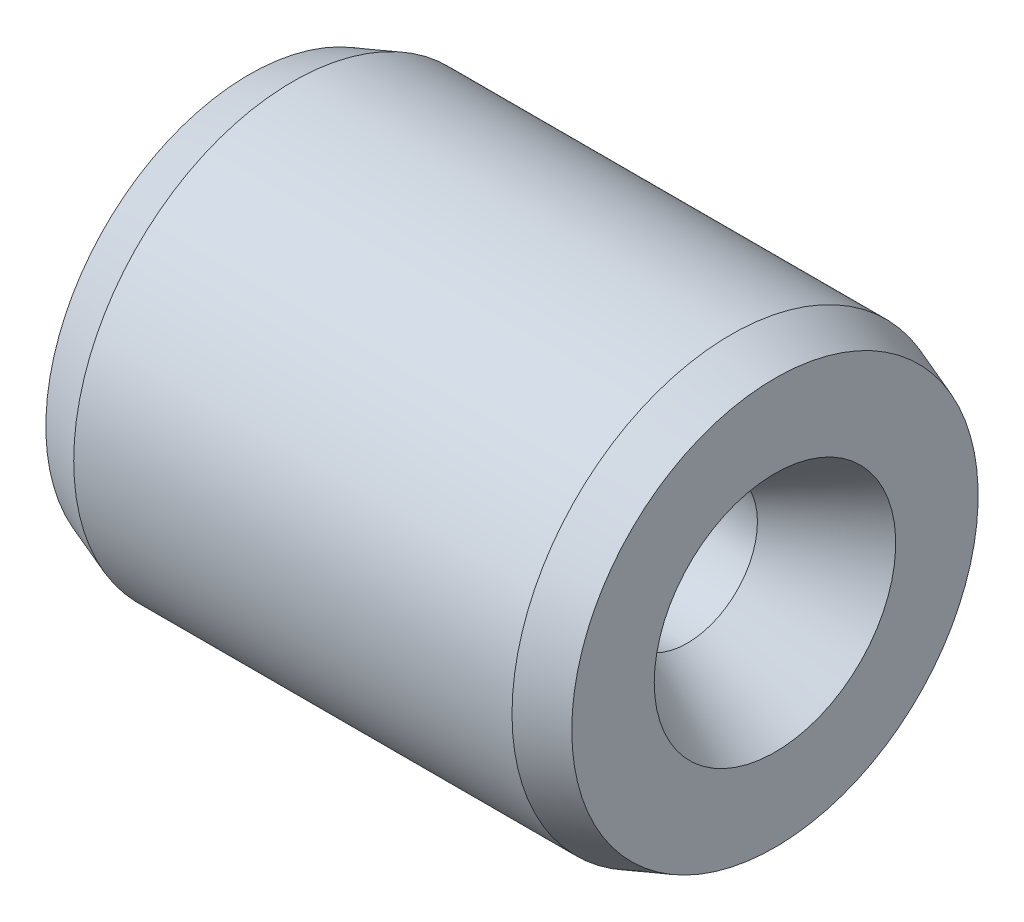
ISO-10303-21;
HEADER;
FILE_DESCRIPTION(('STEP AP214'),'2;1');
FILE_NAME('part.step','',(''),(''),'','','');
FILE_SCHEMA(('AUTOMOTIVE_DESIGN { 1 0 10303 214 1 1 1 1 }'));
ENDSEC;
DATA;
#1=APPLICATION_CONTEXT('core data for automotive mechanical design processes');
#2=APPLICATION_PROTOCOL_DEFINITION('international standard','automotive_design',2000,#1);
#3=PRODUCT_CONTEXT('',#1,'mechanical');
#4=PRODUCT('Part','Part','',(#3));
#5=PRODUCT_RELATED_PRODUCT_CATEGORY('part','',(#4));
#6=PRODUCT_DEFINITION_FORMATION('','',#4);
#7=PRODUCT_DEFINITION_CONTEXT('part definition',#1,'design');
#8=PRODUCT_DEFINITION('design','',#6,#7);
#9=PRODUCT_DEFINITION_SHAPE('','',#8);
#10=(LENGTH_UNIT() NAMED_UNIT(*) SI_UNIT(.MILLI.,.METRE.));
#11=(NAMED_UNIT(*) PLANE_ANGLE_UNIT() SI_UNIT($,.RADIAN.));
#12=(NAMED_UNIT(*) SI_UNIT($,.STERADIAN.) SOLID_ANGLE_UNIT());
#13=UNCERTAINTY_MEASURE_WITH_UNIT(LENGTH_MEASURE(1.E-05),#10,'distance_accuracy_value','');
#14=(GEOMETRIC_REPRESENTATION_CONTEXT(3) GLOBAL_UNCERTAINTY_ASSIGNED_CONTEXT((#13)) GLOBAL_UNIT_ASSIGNED_CONTEXT((#10,
#11,#12)) REPRESENTATION_CONTEXT('',''));
#15=CARTESIAN_POINT('',(0.,0.,0.));
#16=DIRECTION('',(0.,0.,1.));
#17=DIRECTION('',(1.,0.,0.));
#18=AXIS2_PLACEMENT_3D('',#15,#16,#17);
#19=CARTESIAN_POINT('',(6.,0.5,0.));
#20=DIRECTION('',(-1.,0.,0.));
#21=DIRECTION('',(0.,0.,1.));
#22=AXIS2_PLACEMENT_3D('',#19,#20,#21);
#23=PLANE('',#22);
#24=CARTESIAN_POINT('',(6.,0.,0.));
#25=DIRECTION('',(-1.,0.,0.));
#26=DIRECTION('',(0.,0.,1.));
#27=AXIS2_PLACEMENT_3D('',#24,#25,#26);
#28=CIRCLE('',#27,1.37735026918962);
#29=CARTESIAN_POINT('',(6.,0.,1.37735026918962));
#30=VERTEX_POINT('',#29);
#31=EDGE_CURVE('E41',#30,#30,#28,.T.);
#32=ORIENTED_EDGE('',*,*,#31,.T.);
#33=EDGE_LOOP('',(#32));
#34=FACE_BOUND('',#33,.T.);
#35=CARTESIAN_POINT('',(6.,0.,0.));
#36=DIRECTION('',(-1.,0.,0.));
#37=DIRECTION('',(0.,0.,1.));
#38=AXIS2_PLACEMENT_3D('',#35,#36,#37);
#39=CIRCLE('',#38,2.3180148828669);
#40=CARTESIAN_POINT('',(6.,0.,2.3180148828669));
#41=VERTEX_POINT('',#40);
#42=EDGE_CURVE('E54',#41,#41,#39,.F.);
#43=ORIENTED_EDGE('',*,*,#42,.T.);
#44=EDGE_LOOP('',(#43));
#45=FACE_BOUND('',#44,.T.);
#46=ADVANCED_FACE('F34',(#34,#45),#23,.F.);
#47=CARTESIAN_POINT('',(0.,0.5,0.));
#48=DIRECTION('',(1.,0.,0.));
#49=DIRECTION('',(0.,0.,-1.));
#50=AXIS2_PLACEMENT_3D('',#47,#48,#49);
#51=PLANE('',#50);
#52=CARTESIAN_POINT('',(0.,0.,0.));
#53=DIRECTION('',(1.,0.,0.));
#54=DIRECTION('',(0.,0.,-1.));
#55=AXIS2_PLACEMENT_3D('',#52,#53,#54);
#56=CIRCLE('',#55,1.37735026918962);
#57=CARTESIAN_POINT('',(0.,0.,-1.37735026918962));
#58=VERTEX_POINT('',#57);
#59=EDGE_CURVE('E10',#58,#58,#56,.T.);
#60=ORIENTED_EDGE('',*,*,#59,.T.);
#61=EDGE_LOOP('',(#60));
#62=FACE_BOUND('',#61,.T.);
#63=CARTESIAN_POINT('',(0.,0.,0.));
#64=DIRECTION('',(1.,0.,0.));
#65=DIRECTION('',(0.,0.,-1.));
#66=AXIS2_PLACEMENT_3D('',#63,#64,#65);
#67=CIRCLE('',#66,2.3180148828669);
#68=CARTESIAN_POINT('',(0.,0.,-2.3180148828669));
#69=VERTEX_POINT('',#68);
#70=EDGE_CURVE('E63',#69,#69,#67,.F.);
#71=ORIENTED_EDGE('',*,*,#70,.T.);
#72=EDGE_LOOP('',(#71));
#73=FACE_BOUND('',#72,.T.);
#74=ADVANCED_FACE('F67',(#62,#73),#51,.F.);
#75=CARTESIAN_POINT('',(0.,0.,0.));
#76=DIRECTION('',(-1.,0.,0.));
#77=DIRECTION('',(0.,0.,1.));
#78=AXIS2_PLACEMENT_3D('',#75,#76,#77);
#79=CYLINDRICAL_SURFACE('',#78,2.5);
#80=CARTESIAN_POINT('',(0.500000000000004,0.,0.));
#81=DIRECTION('',(1.,0.,0.));
#82=DIRECTION('',(0.,0.,-1.));
#83=AXIS2_PLACEMENT_3D('',#80,#81,#82);
#84=CIRCLE('',#83,2.5);
#85=CARTESIAN_POINT('',(0.500000000000004,0.,-2.5));
#86=VERTEX_POINT('',#85);
#87=EDGE_CURVE('E57',#86,#86,#84,.T.);
#88=ORIENTED_EDGE('',*,*,#87,.T.);
#89=EDGE_LOOP('',(#88));
#90=FACE_BOUND('',#89,.T.);
#91=CARTESIAN_POINT('',(5.5,0.,0.));
#92=DIRECTION('',(-1.,0.,0.));
#93=DIRECTION('',(0.,0.,1.));
#94=AXIS2_PLACEMENT_3D('',#91,#92,#93);
#95=CIRCLE('',#94,2.5);
#96=CARTESIAN_POINT('',(5.5,0.,2.5));
#97=VERTEX_POINT('',#96);
#98=EDGE_CURVE('E60',#97,#97,#95,.T.);
#99=ORIENTED_EDGE('',*,*,#98,.T.);
#100=EDGE_LOOP('',(#99));
#101=FACE_BOUND('',#100,.T.);
#102=ADVANCED_FACE('F82',(#90,#101),#79,.T.);
#103=CARTESIAN_POINT('',(6.,0.,0.));
#104=DIRECTION('',(1.,0.,0.));
#105=DIRECTION('',(0.,0.,-1.));
#106=AXIS2_PLACEMENT_3D('',#103,#104,#105);
#107=CYLINDRICAL_SURFACE('',#106,0.799999999999999);
#108=CARTESIAN_POINT('',(4.99999999999999,0.,0.));
#109=DIRECTION('',(-1.,0.,0.));
#110=DIRECTION('',(0.,0.,1.));
#111=AXIS2_PLACEMENT_3D('',#108,#109,#110);
#112=CIRCLE('',#111,0.799999999999999);
#113=CARTESIAN_POINT('',(4.99999999999999,0.,0.799999999999999));
#114=VERTEX_POINT('',#113);
#115=EDGE_CURVE('E45',#114,#114,#112,.F.);
#116=ORIENTED_EDGE('',*,*,#115,.T.);
#117=EDGE_LOOP('',(#116));
#118=FACE_BOUND('',#117,.T.);
#119=CARTESIAN_POINT('',(1.,0.,0.));
#120=DIRECTION('',(1.,0.,0.));
#121=DIRECTION('',(0.,0.,-1.));
#122=AXIS2_PLACEMENT_3D('',#119,#120,#121);
#123=CIRCLE('',#122,0.799999999999999);
#124=CARTESIAN_POINT('',(1.,0.,-0.799999999999999));
#125=VERTEX_POINT('',#124);
#126=EDGE_CURVE('E49',#125,#125,#123,.F.);
#127=ORIENTED_EDGE('',*,*,#126,.T.);
#128=EDGE_LOOP('',(#127));
#129=FACE_BOUND('',#128,.T.);
#130=ADVANCED_FACE('F72',(#118,#129),#107,.F.);
#131=CARTESIAN_POINT('',(0.,0.,0.));
#132=DIRECTION('',(1.,0.,0.));
#133=DIRECTION('',(0.,0.,-1.));
#134=AXIS2_PLACEMENT_3D('',#131,#132,#133);
#135=CONICAL_SURFACE('',#134,2.3180148828669,0.349065850398864);
#136=ORIENTED_EDGE('',*,*,#87,.F.);
#137=EDGE_LOOP('',(#136));
#138=FACE_BOUND('',#137,.T.);
#139=ORIENTED_EDGE('',*,*,#70,.F.);
#140=EDGE_LOOP('',(#139));
#141=FACE_BOUND('',#140,.T.);
#142=ADVANCED_FACE('F69',(#138,#141),#135,.T.);
#143=CARTESIAN_POINT('',(5.5,0.,0.));
#144=DIRECTION('',(-1.,0.,0.));
#145=DIRECTION('',(0.,0.,1.));
#146=AXIS2_PLACEMENT_3D('',#143,#144,#145);
#147=CONICAL_SURFACE('',#146,2.5,0.349065850398864);
#148=ORIENTED_EDGE('',*,*,#42,.F.);
#149=EDGE_LOOP('',(#148));
#150=FACE_BOUND('',#149,.T.);
#151=ORIENTED_EDGE('',*,*,#98,.F.);
#152=EDGE_LOOP('',(#151));
#153=FACE_BOUND('',#152,.T.);
#154=ADVANCED_FACE('F71',(#150,#153),#147,.T.);
#155=CARTESIAN_POINT('',(4.99999999999999,0.,0.));
#156=DIRECTION('',(1.,0.,0.));
#157=DIRECTION('',(0.,0.,-1.));
#158=AXIS2_PLACEMENT_3D('',#155,#156,#157);
#159=CONICAL_SURFACE('',#158,0.799999999999999,0.523598775598297);
#160=ORIENTED_EDGE('',*,*,#31,.F.);
#161=EDGE_LOOP('',(#160));
#162=FACE_BOUND('',#161,.T.);
#163=ORIENTED_EDGE('',*,*,#115,.F.);
#164=EDGE_LOOP('',(#163));
#165=FACE_BOUND('',#164,.T.);
#166=ADVANCED_FACE('F79',(#162,#165),#159,.F.);
#167=CARTESIAN_POINT('',(0.,0.,0.));
#168=DIRECTION('',(-1.,0.,0.));
#169=DIRECTION('',(0.,0.,1.));
#170=AXIS2_PLACEMENT_3D('',#167,#168,#169);
#171=CONICAL_SURFACE('',#170,1.37735026918962,0.523598775598297);
#172=ORIENTED_EDGE('',*,*,#126,.F.);
#173=EDGE_LOOP('',(#172));
#174=FACE_BOUND('',#173,.T.);
#175=ORIENTED_EDGE('',*,*,#59,.F.);
#176=EDGE_LOOP('',(#175));
#177=FACE_BOUND('',#176,.T.);
#178=ADVANCED_FACE('F36',(#174,#177),#171,.F.);
#179=CLOSED_SHELL('',(#46,#74,#102,#130,#142,#154,#166,#178));
#180=MANIFOLD_SOLID_BREP('B2',#179);
#181=ADVANCED_BREP_SHAPE_REPRESENTATION('',(#18,#180),#14);
#182=SHAPE_DEFINITION_REPRESENTATION(#9,#181);
ENDSEC;
END-ISO-10303-21;
